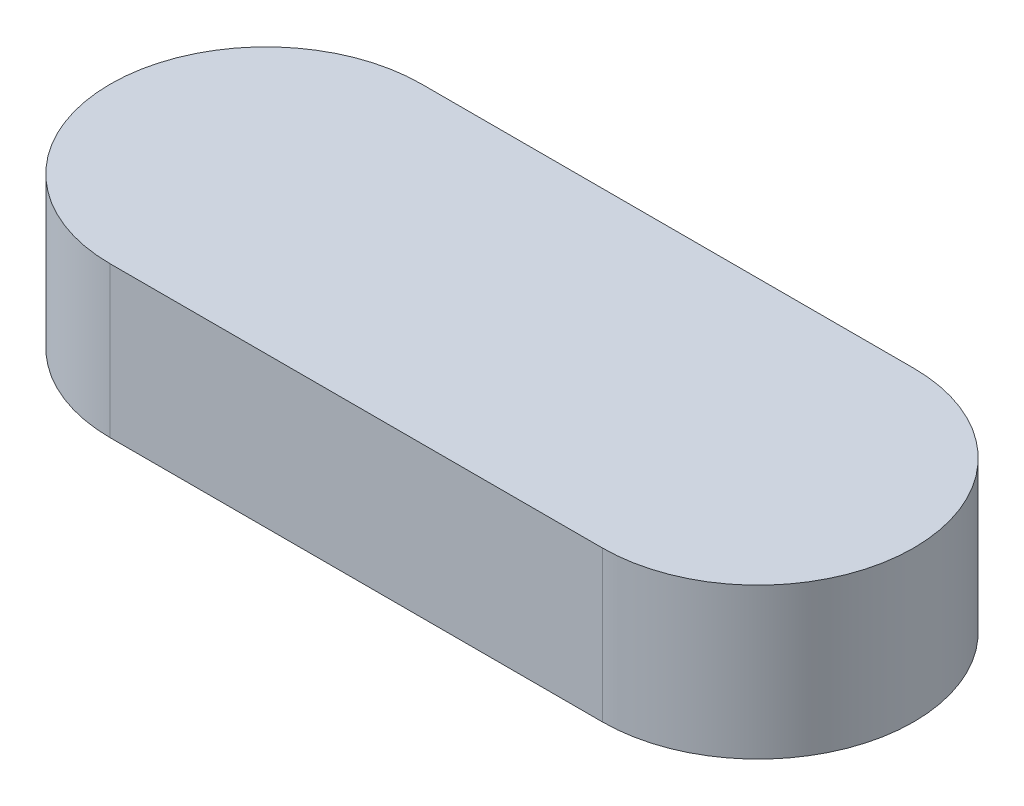
ISO-10303-21;
HEADER;
FILE_DESCRIPTION(('STEP AP214'),'2;1');
FILE_NAME('part.step','',(''),(''),'','','');
FILE_SCHEMA(('AUTOMOTIVE_DESIGN { 1 0 10303 214 1 1 1 1 }'));
ENDSEC;
DATA;
#1=APPLICATION_CONTEXT('core data for automotive mechanical design processes');
#2=APPLICATION_PROTOCOL_DEFINITION('international standard','automotive_design',2000,#1);
#3=PRODUCT_CONTEXT('',#1,'mechanical');
#4=PRODUCT('Part','Part','',(#3));
#5=PRODUCT_RELATED_PRODUCT_CATEGORY('part','',(#4));
#6=PRODUCT_DEFINITION_FORMATION('','',#4);
#7=PRODUCT_DEFINITION_CONTEXT('part definition',#1,'design');
#8=PRODUCT_DEFINITION('design','',#6,#7);
#9=PRODUCT_DEFINITION_SHAPE('','',#8);
#10=(LENGTH_UNIT() NAMED_UNIT(*) SI_UNIT(.MILLI.,.METRE.));
#11=(NAMED_UNIT(*) PLANE_ANGLE_UNIT() SI_UNIT($,.RADIAN.));
#12=(NAMED_UNIT(*) SI_UNIT($,.STERADIAN.) SOLID_ANGLE_UNIT());
#13=UNCERTAINTY_MEASURE_WITH_UNIT(LENGTH_MEASURE(1.E-05),#10,'distance_accuracy_value','');
#14=(GEOMETRIC_REPRESENTATION_CONTEXT(3) GLOBAL_UNCERTAINTY_ASSIGNED_CONTEXT((#13)) GLOBAL_UNIT_ASSIGNED_CONTEXT((#10,
#11,#12)) REPRESENTATION_CONTEXT('',''));
#15=CARTESIAN_POINT('',(0.,0.,0.));
#16=DIRECTION('',(0.,0.,1.));
#17=DIRECTION('',(1.,0.,0.));
#18=AXIS2_PLACEMENT_3D('',#15,#16,#17);
#19=CARTESIAN_POINT('',(-9.5421052631579,7.5,0.));
#20=DIRECTION('',(0.,-1.,0.));
#21=DIRECTION('',(0.,0.,-1.));
#22=AXIS2_PLACEMENT_3D('',#19,#20,#21);
#23=CYLINDRICAL_SURFACE('',#22,7.75);
#24=CARTESIAN_POINT('',(-9.5421052631579,0.,0.));
#25=DIRECTION('',(0.,1.,0.));
#26=DIRECTION('',(0.,0.,1.));
#27=AXIS2_PLACEMENT_3D('',#24,#25,#26);
#28=CIRCLE('',#27,7.75);
#29=CARTESIAN_POINT('',(-9.5421052631579,0.,-7.75));
#30=VERTEX_POINT('',#29);
#31=CARTESIAN_POINT('',(-9.5421052631579,0.,7.75));
#32=VERTEX_POINT('',#31);
#33=EDGE_CURVE('E113',#30,#32,#28,.T.);
#34=ORIENTED_EDGE('',*,*,#33,.T.);
#35=DIRECTION('',(0.,-1.,0.));
#36=VECTOR('',#35,1.);
#37=CARTESIAN_POINT('',(-9.5421052631579,7.5,7.75));
#38=LINE('',#37,#36);
#39=CARTESIAN_POINT('',(-9.5421052631579,7.5,7.75));
#40=VERTEX_POINT('',#39);
#41=EDGE_CURVE('E11',#40,#32,#38,.T.);
#42=ORIENTED_EDGE('',*,*,#41,.F.);
#43=CARTESIAN_POINT('',(-9.5421052631579,7.5,0.));
#44=DIRECTION('',(0.,1.,0.));
#45=DIRECTION('',(0.,0.,1.));
#46=AXIS2_PLACEMENT_3D('',#43,#44,#45);
#47=CIRCLE('',#46,7.75);
#48=CARTESIAN_POINT('',(-9.5421052631579,7.5,-7.75));
#49=VERTEX_POINT('',#48);
#50=EDGE_CURVE('E97',#49,#40,#47,.T.);
#51=ORIENTED_EDGE('',*,*,#50,.F.);
#52=DIRECTION('',(0.,-1.,0.));
#53=VECTOR('',#52,1.);
#54=CARTESIAN_POINT('',(-9.5421052631579,7.5,-7.75));
#55=LINE('',#54,#53);
#56=EDGE_CURVE('E109',#49,#30,#55,.T.);
#57=ORIENTED_EDGE('',*,*,#56,.T.);
#58=EDGE_LOOP('',(#34,#42,#51,#57));
#59=FACE_BOUND('',#58,.T.);
#60=ADVANCED_FACE('F45',(#59),#23,.T.);
#61=CARTESIAN_POINT('',(-9.5421052631579,7.5,7.75));
#62=DIRECTION('',(0.,0.,-1.));
#63=DIRECTION('',(-1.,0.,0.));
#64=AXIS2_PLACEMENT_3D('',#61,#62,#63);
#65=PLANE('',#64);
#66=DIRECTION('',(1.,0.,0.));
#67=VECTOR('',#66,1.);
#68=CARTESIAN_POINT('',(-9.5421052631579,0.,7.75));
#69=LINE('',#68,#67);
#70=CARTESIAN_POINT('',(14.9578947368421,0.,7.75));
#71=VERTEX_POINT('',#70);
#72=EDGE_CURVE('E102',#32,#71,#69,.T.);
#73=ORIENTED_EDGE('',*,*,#72,.T.);
#74=DIRECTION('',(0.,-1.,0.));
#75=VECTOR('',#74,1.);
#76=CARTESIAN_POINT('',(14.9578947368421,7.5,7.75));
#77=LINE('',#76,#75);
#78=CARTESIAN_POINT('',(14.9578947368421,7.5,7.75));
#79=VERTEX_POINT('',#78);
#80=EDGE_CURVE('E54',#79,#71,#77,.T.);
#81=ORIENTED_EDGE('',*,*,#80,.F.);
#82=DIRECTION('',(1.,0.,0.));
#83=VECTOR('',#82,1.);
#84=CARTESIAN_POINT('',(-9.5421052631579,7.5,7.75));
#85=LINE('',#84,#83);
#86=EDGE_CURVE('E92',#40,#79,#85,.T.);
#87=ORIENTED_EDGE('',*,*,#86,.F.);
#88=ORIENTED_EDGE('',*,*,#41,.T.);
#89=EDGE_LOOP('',(#73,#81,#87,#88));
#90=FACE_BOUND('',#89,.T.);
#91=ADVANCED_FACE('F101',(#90),#65,.F.);
#92=CARTESIAN_POINT('',(14.9578947368421,7.5,0.));
#93=DIRECTION('',(0.,-1.,0.));
#94=DIRECTION('',(0.,0.,-1.));
#95=AXIS2_PLACEMENT_3D('',#92,#93,#94);
#96=CYLINDRICAL_SURFACE('',#95,7.75);
#97=CARTESIAN_POINT('',(14.9578947368421,0.,0.));
#98=DIRECTION('',(0.,1.,0.));
#99=DIRECTION('',(0.,0.,1.));
#100=AXIS2_PLACEMENT_3D('',#97,#98,#99);
#101=CIRCLE('',#100,7.75);
#102=CARTESIAN_POINT('',(14.9578947368421,0.,-7.75));
#103=VERTEX_POINT('',#102);
#104=EDGE_CURVE('E79',#71,#103,#101,.T.);
#105=ORIENTED_EDGE('',*,*,#104,.T.);
#106=DIRECTION('',(0.,-1.,0.));
#107=VECTOR('',#106,1.);
#108=CARTESIAN_POINT('',(14.9578947368421,7.5,-7.75));
#109=LINE('',#108,#107);
#110=CARTESIAN_POINT('',(14.9578947368421,7.5,-7.75));
#111=VERTEX_POINT('',#110);
#112=EDGE_CURVE('E104',#111,#103,#109,.T.);
#113=ORIENTED_EDGE('',*,*,#112,.F.);
#114=CARTESIAN_POINT('',(14.9578947368421,7.5,0.));
#115=DIRECTION('',(0.,1.,0.));
#116=DIRECTION('',(0.,0.,1.));
#117=AXIS2_PLACEMENT_3D('',#114,#115,#116);
#118=CIRCLE('',#117,7.75);
#119=EDGE_CURVE('E95',#79,#111,#118,.T.);
#120=ORIENTED_EDGE('',*,*,#119,.F.);
#121=ORIENTED_EDGE('',*,*,#80,.T.);
#122=EDGE_LOOP('',(#105,#113,#120,#121));
#123=FACE_BOUND('',#122,.T.);
#124=ADVANCED_FACE('F105',(#123),#96,.T.);
#125=CARTESIAN_POINT('',(-9.5421052631579,7.5,-7.75));
#126=DIRECTION('',(0.,0.,1.));
#127=DIRECTION('',(1.,0.,0.));
#128=AXIS2_PLACEMENT_3D('',#125,#126,#127);
#129=PLANE('',#128);
#130=DIRECTION('',(-1.,0.,0.));
#131=VECTOR('',#130,1.);
#132=CARTESIAN_POINT('',(-9.5421052631579,0.,-7.75));
#133=LINE('',#132,#131);
#134=EDGE_CURVE('E85',#103,#30,#133,.T.);
#135=ORIENTED_EDGE('',*,*,#134,.T.);
#136=ORIENTED_EDGE('',*,*,#56,.F.);
#137=DIRECTION('',(-1.,0.,0.));
#138=VECTOR('',#137,1.);
#139=CARTESIAN_POINT('',(-9.5421052631579,7.5,-7.75));
#140=LINE('',#139,#138);
#141=EDGE_CURVE('E62',#111,#49,#140,.T.);
#142=ORIENTED_EDGE('',*,*,#141,.F.);
#143=ORIENTED_EDGE('',*,*,#112,.T.);
#144=EDGE_LOOP('',(#135,#136,#142,#143));
#145=FACE_BOUND('',#144,.T.);
#146=ADVANCED_FACE('F126',(#145),#129,.F.);
#147=CARTESIAN_POINT('',(-9.5421052631579,7.5,0.));
#148=DIRECTION('',(0.,1.,0.));
#149=DIRECTION('',(0.,0.,1.));
#150=AXIS2_PLACEMENT_3D('',#147,#148,#149);
#151=PLANE('',#150);
#152=ORIENTED_EDGE('',*,*,#50,.T.);
#153=ORIENTED_EDGE('',*,*,#86,.T.);
#154=ORIENTED_EDGE('',*,*,#119,.T.);
#155=ORIENTED_EDGE('',*,*,#141,.T.);
#156=EDGE_LOOP('',(#152,#153,#154,#155));
#157=FACE_BOUND('',#156,.T.);
#158=ADVANCED_FACE('F93',(#157),#151,.T.);
#159=CARTESIAN_POINT('',(-9.5421052631579,0.,0.));
#160=DIRECTION('',(0.,1.,0.));
#161=DIRECTION('',(0.,0.,1.));
#162=AXIS2_PLACEMENT_3D('',#159,#160,#161);
#163=PLANE('',#162);
#164=ORIENTED_EDGE('',*,*,#33,.F.);
#165=ORIENTED_EDGE('',*,*,#134,.F.);
#166=ORIENTED_EDGE('',*,*,#104,.F.);
#167=ORIENTED_EDGE('',*,*,#72,.F.);
#168=EDGE_LOOP('',(#164,#165,#166,#167));
#169=FACE_BOUND('',#168,.T.);
#170=ADVANCED_FACE('F129',(#169),#163,.F.);
#171=CLOSED_SHELL('',(#60,#91,#124,#146,#158,#170));
#172=MANIFOLD_SOLID_BREP('B2',#171);
#173=ADVANCED_BREP_SHAPE_REPRESENTATION('',(#18,#172),#14);
#174=SHAPE_DEFINITION_REPRESENTATION(#9,#173);
ENDSEC;
END-ISO-10303-21;
